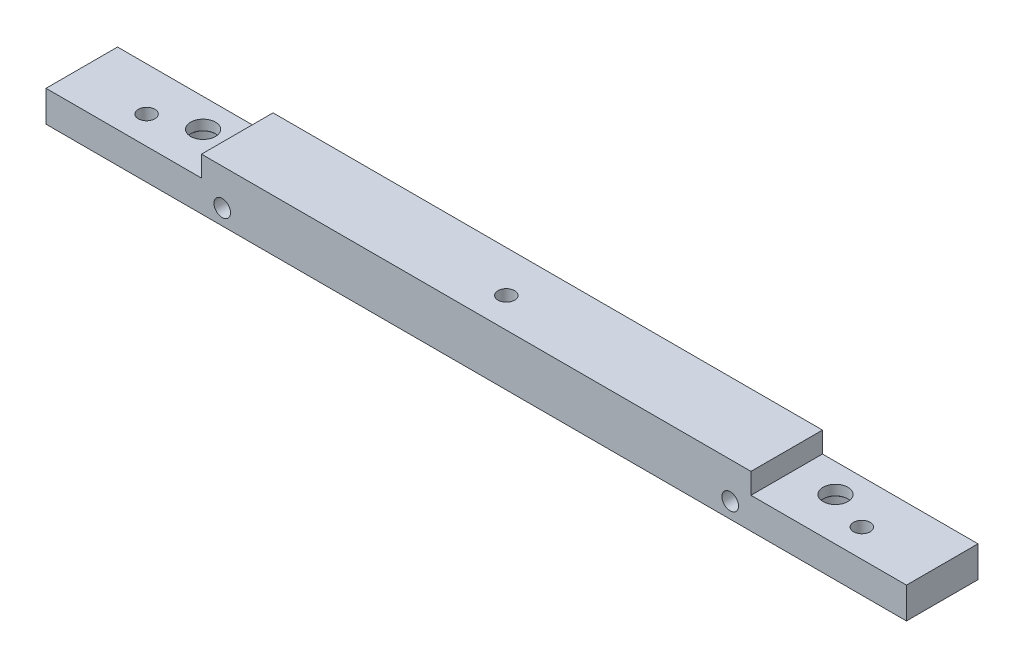
ISO-10303-21;
HEADER;
FILE_DESCRIPTION(('STEP AP214'),'2;1');
FILE_NAME('part.step','',(''),(''),'','','');
FILE_SCHEMA(('AUTOMOTIVE_DESIGN { 1 0 10303 214 1 1 1 1 }'));
ENDSEC;
DATA;
#1=APPLICATION_CONTEXT('core data for automotive mechanical design processes');
#2=APPLICATION_PROTOCOL_DEFINITION('international standard','automotive_design',2000,#1);
#3=PRODUCT_CONTEXT('',#1,'mechanical');
#4=PRODUCT('Part','Part','',(#3));
#5=PRODUCT_RELATED_PRODUCT_CATEGORY('part','',(#4));
#6=PRODUCT_DEFINITION_FORMATION('','',#4);
#7=PRODUCT_DEFINITION_CONTEXT('part definition',#1,'design');
#8=PRODUCT_DEFINITION('design','',#6,#7);
#9=PRODUCT_DEFINITION_SHAPE('','',#8);
#10=(LENGTH_UNIT() NAMED_UNIT(*) SI_UNIT(.MILLI.,.METRE.));
#11=(NAMED_UNIT(*) PLANE_ANGLE_UNIT() SI_UNIT($,.RADIAN.));
#12=(NAMED_UNIT(*) SI_UNIT($,.STERADIAN.) SOLID_ANGLE_UNIT());
#13=UNCERTAINTY_MEASURE_WITH_UNIT(LENGTH_MEASURE(1.E-05),#10,'distance_accuracy_value','');
#14=(GEOMETRIC_REPRESENTATION_CONTEXT(3) GLOBAL_UNCERTAINTY_ASSIGNED_CONTEXT((#13)) GLOBAL_UNIT_ASSIGNED_CONTEXT((#10,
#11,#12)) REPRESENTATION_CONTEXT('',''));
#15=CARTESIAN_POINT('',(0.,0.,0.));
#16=DIRECTION('',(0.,0.,1.));
#17=DIRECTION('',(1.,0.,0.));
#18=AXIS2_PLACEMENT_3D('',#15,#16,#17);
#19=CARTESIAN_POINT('',(0.,0.,8.5));
#20=DIRECTION('',(1.,0.,0.));
#21=DIRECTION('',(0.,1.,0.));
#22=AXIS2_PLACEMENT_3D('',#19,#20,#21);
#23=PLANE('',#22);
#24=DIRECTION('',(0.,0.,-1.));
#25=VECTOR('',#24,1.);
#26=CARTESIAN_POINT('',(0.,-3.,8.5));
#27=LINE('',#26,#25);
#28=CARTESIAN_POINT('',(0.,-3.,6.89999999999999));
#29=VERTEX_POINT('',#28);
#30=CARTESIAN_POINT('',(0.,-3.,0.));
#31=VERTEX_POINT('',#30);
#32=EDGE_CURVE('E11',#29,#31,#27,.T.);
#33=ORIENTED_EDGE('',*,*,#32,.F.);
#34=DIRECTION('',(0.,1.,0.));
#35=VECTOR('',#34,1.);
#36=CARTESIAN_POINT('',(0.,0.,6.89999999999999));
#37=LINE('',#36,#35);
#38=CARTESIAN_POINT('',(0.,-1.,6.89999999999999));
#39=VERTEX_POINT('',#38);
#40=EDGE_CURVE('E201',#29,#39,#37,.T.);
#41=ORIENTED_EDGE('',*,*,#40,.T.);
#42=DIRECTION('',(0.,0.,1.));
#43=VECTOR('',#42,1.);
#44=CARTESIAN_POINT('',(0.,-1.,0.));
#45=LINE('',#44,#43);
#46=CARTESIAN_POINT('',(0.,-1.,0.));
#47=VERTEX_POINT('',#46);
#48=EDGE_CURVE('E217',#47,#39,#45,.T.);
#49=ORIENTED_EDGE('',*,*,#48,.F.);
#50=DIRECTION('',(0.,-1.,0.));
#51=VECTOR('',#50,1.);
#52=CARTESIAN_POINT('',(0.,0.,0.));
#53=LINE('',#52,#51);
#54=EDGE_CURVE('E136',#47,#31,#53,.T.);
#55=ORIENTED_EDGE('',*,*,#54,.T.);
#56=EDGE_LOOP('',(#33,#41,#49,#55));
#57=FACE_BOUND('',#56,.T.);
#58=ADVANCED_FACE('F40',(#57),#23,.F.);
#59=CARTESIAN_POINT('',(-15.,-3.,8.5));
#60=DIRECTION('',(0.,-1.,0.));
#61=DIRECTION('',(1.,0.,0.));
#62=AXIS2_PLACEMENT_3D('',#59,#60,#61);
#63=PLANE('',#62);
#64=CARTESIAN_POINT('',(-8.,-3.,4.19999999999999));
#65=DIRECTION('',(0.,-1.,0.));
#66=DIRECTION('',(1.,0.,0.));
#67=AXIS2_PLACEMENT_3D('',#64,#65,#66);
#68=CIRCLE('',#67,0.799999999999993);
#69=CARTESIAN_POINT('',(-7.2,-3.,4.19999999999999));
#70=VERTEX_POINT('',#69);
#71=EDGE_CURVE('E440',#70,#70,#68,.T.);
#72=ORIENTED_EDGE('',*,*,#71,.T.);
#73=EDGE_LOOP('',(#72));
#74=FACE_BOUND('',#73,.T.);
#75=CARTESIAN_POINT('',(-4.,-3.,2.75));
#76=DIRECTION('',(0.,-1.,0.));
#77=DIRECTION('',(1.,0.,0.));
#78=AXIS2_PLACEMENT_3D('',#75,#76,#77);
#79=CIRCLE('',#78,1.2);
#80=CARTESIAN_POINT('',(-2.8,-3.,2.75));
#81=VERTEX_POINT('',#80);
#82=EDGE_CURVE('E138',#81,#81,#79,.T.);
#83=ORIENTED_EDGE('',*,*,#82,.T.);
#84=EDGE_LOOP('',(#83));
#85=FACE_BOUND('',#84,.T.);
#86=DIRECTION('',(0.,0.,-1.));
#87=VECTOR('',#86,1.);
#88=CARTESIAN_POINT('',(-15.,-3.,8.5));
#89=LINE('',#88,#87);
#90=CARTESIAN_POINT('',(-15.,-3.,6.89999999999999));
#91=VERTEX_POINT('',#90);
#92=CARTESIAN_POINT('',(-15.,-3.,0.));
#93=VERTEX_POINT('',#92);
#94=EDGE_CURVE('E48',#91,#93,#89,.T.);
#95=ORIENTED_EDGE('',*,*,#94,.F.);
#96=DIRECTION('',(1.,0.,0.));
#97=VECTOR('',#96,1.);
#98=CARTESIAN_POINT('',(-15.,-3.,6.89999999999999));
#99=LINE('',#98,#97);
#100=EDGE_CURVE('E109',#91,#29,#99,.T.);
#101=ORIENTED_EDGE('',*,*,#100,.T.);
#102=ORIENTED_EDGE('',*,*,#32,.T.);
#103=DIRECTION('',(-1.,0.,0.));
#104=VECTOR('',#103,1.);
#105=CARTESIAN_POINT('',(-15.,-3.,0.));
#106=LINE('',#105,#104);
#107=EDGE_CURVE('E166',#31,#93,#106,.T.);
#108=ORIENTED_EDGE('',*,*,#107,.T.);
#109=EDGE_LOOP('',(#95,#101,#102,#108));
#110=FACE_BOUND('',#109,.T.);
#111=ADVANCED_FACE('F258',(#74,#85,#110),#63,.F.);
#112=CARTESIAN_POINT('',(-15.,-3.,8.5));
#113=DIRECTION('',(1.,0.,0.));
#114=DIRECTION('',(0.,0.,-1.));
#115=AXIS2_PLACEMENT_3D('',#112,#113,#114);
#116=PLANE('',#115);
#117=DIRECTION('',(0.,0.,-1.));
#118=VECTOR('',#117,1.);
#119=CARTESIAN_POINT('',(-15.,-6.,8.5));
#120=LINE('',#119,#118);
#121=CARTESIAN_POINT('',(-15.,-6.,6.89999999999999));
#122=VERTEX_POINT('',#121);
#123=CARTESIAN_POINT('',(-15.,-6.,0.));
#124=VERTEX_POINT('',#123);
#125=EDGE_CURVE('E119',#122,#124,#120,.T.);
#126=ORIENTED_EDGE('',*,*,#125,.F.);
#127=DIRECTION('',(0.,-1.,0.));
#128=VECTOR('',#127,1.);
#129=CARTESIAN_POINT('',(-15.,4.,6.89999999999999));
#130=LINE('',#129,#128);
#131=EDGE_CURVE('E103',#91,#122,#130,.T.);
#132=ORIENTED_EDGE('',*,*,#131,.F.);
#133=ORIENTED_EDGE('',*,*,#94,.T.);
#134=DIRECTION('',(0.,-1.,0.));
#135=VECTOR('',#134,1.);
#136=CARTESIAN_POINT('',(-15.,-3.,0.));
#137=LINE('',#136,#135);
#138=EDGE_CURVE('E126',#93,#124,#137,.T.);
#139=ORIENTED_EDGE('',*,*,#138,.T.);
#140=EDGE_LOOP('',(#126,#132,#133,#139));
#141=FACE_BOUND('',#140,.T.);
#142=ADVANCED_FACE('F124',(#141),#116,.F.);
#143=CARTESIAN_POINT('',(-15.,-6.,8.5));
#144=DIRECTION('',(0.,1.,0.));
#145=DIRECTION('',(-1.,0.,0.));
#146=AXIS2_PLACEMENT_3D('',#143,#144,#145);
#147=PLANE('',#146);
#148=CARTESIAN_POINT('',(26.5,-6.,4.));
#149=DIRECTION('',(0.,-1.,0.));
#150=DIRECTION('',(0.,0.,-1.));
#151=AXIS2_PLACEMENT_3D('',#148,#149,#150);
#152=CIRCLE('',#151,0.799999999999999);
#153=CARTESIAN_POINT('',(26.5,-6.,3.2));
#154=VERTEX_POINT('',#153);
#155=EDGE_CURVE('E434',#154,#154,#152,.T.);
#156=ORIENTED_EDGE('',*,*,#155,.F.);
#157=EDGE_LOOP('',(#156));
#158=FACE_BOUND('',#157,.T.);
#159=CARTESIAN_POINT('',(-8.,-6.,4.19999999999999));
#160=DIRECTION('',(0.,-1.,0.));
#161=DIRECTION('',(0.,0.,-1.));
#162=AXIS2_PLACEMENT_3D('',#159,#160,#161);
#163=CIRCLE('',#162,0.799999999999988);
#164=CARTESIAN_POINT('',(-8.,-6.,3.4));
#165=VERTEX_POINT('',#164);
#166=EDGE_CURVE('E437',#165,#165,#163,.T.);
#167=ORIENTED_EDGE('',*,*,#166,.F.);
#168=EDGE_LOOP('',(#167));
#169=FACE_BOUND('',#168,.T.);
#170=CARTESIAN_POINT('',(61.,-6.,4.2));
#171=DIRECTION('',(0.,-1.,0.));
#172=DIRECTION('',(0.,0.,-1.));
#173=AXIS2_PLACEMENT_3D('',#170,#171,#172);
#174=CIRCLE('',#173,0.799999999999988);
#175=CARTESIAN_POINT('',(61.,-6.,3.40000000000001));
#176=VERTEX_POINT('',#175);
#177=EDGE_CURVE('E446',#176,#176,#174,.T.);
#178=ORIENTED_EDGE('',*,*,#177,.F.);
#179=EDGE_LOOP('',(#178));
#180=FACE_BOUND('',#179,.T.);
#181=CARTESIAN_POINT('',(-4.,-6.,2.75));
#182=DIRECTION('',(0.,-1.,0.));
#183=DIRECTION('',(0.,0.,-1.));
#184=AXIS2_PLACEMENT_3D('',#181,#182,#183);
#185=CIRCLE('',#184,2.2);
#186=CARTESIAN_POINT('',(-4.,-6.,0.550000000000001));
#187=VERTEX_POINT('',#186);
#188=EDGE_CURVE('E219',#187,#187,#185,.T.);
#189=ORIENTED_EDGE('',*,*,#188,.F.);
#190=EDGE_LOOP('',(#189));
#191=FACE_BOUND('',#190,.T.);
#192=CARTESIAN_POINT('',(57.,-6.,2.75));
#193=DIRECTION('',(0.,-1.,0.));
#194=DIRECTION('',(0.,0.,-1.));
#195=AXIS2_PLACEMENT_3D('',#192,#193,#194);
#196=CIRCLE('',#195,2.2);
#197=CARTESIAN_POINT('',(57.,-6.,0.55));
#198=VERTEX_POINT('',#197);
#199=EDGE_CURVE('E140',#198,#198,#196,.T.);
#200=ORIENTED_EDGE('',*,*,#199,.F.);
#201=EDGE_LOOP('',(#200));
#202=FACE_BOUND('',#201,.T.);
#203=DIRECTION('',(0.,0.,-1.));
#204=VECTOR('',#203,1.);
#205=CARTESIAN_POINT('',(68.,-6.,8.5));
#206=LINE('',#205,#204);
#207=CARTESIAN_POINT('',(68.,-6.,6.9));
#208=VERTEX_POINT('',#207);
#209=CARTESIAN_POINT('',(68.,-6.,0.));
#210=VERTEX_POINT('',#209);
#211=EDGE_CURVE('E121',#208,#210,#206,.T.);
#212=ORIENTED_EDGE('',*,*,#211,.F.);
#213=DIRECTION('',(1.,0.,0.));
#214=VECTOR('',#213,1.);
#215=CARTESIAN_POINT('',(68.,-6.,6.9));
#216=LINE('',#215,#214);
#217=EDGE_CURVE('E106',#122,#208,#216,.T.);
#218=ORIENTED_EDGE('',*,*,#217,.F.);
#219=ORIENTED_EDGE('',*,*,#125,.T.);
#220=DIRECTION('',(1.,0.,0.));
#221=VECTOR('',#220,1.);
#222=CARTESIAN_POINT('',(-15.,-6.,0.));
#223=LINE('',#222,#221);
#224=EDGE_CURVE('E170',#124,#210,#223,.T.);
#225=ORIENTED_EDGE('',*,*,#224,.T.);
#226=EDGE_LOOP('',(#212,#218,#219,#225));
#227=FACE_BOUND('',#226,.T.);
#228=ADVANCED_FACE('F117',(#158,#169,#180,#191,#202,#227),#147,.F.);
#229=CARTESIAN_POINT('',(68.,-2.99999999999999,8.5));
#230=DIRECTION('',(-1.,0.,0.));
#231=DIRECTION('',(0.,0.,1.));
#232=AXIS2_PLACEMENT_3D('',#229,#230,#231);
#233=PLANE('',#232);
#234=DIRECTION('',(0.,0.,-1.));
#235=VECTOR('',#234,1.);
#236=CARTESIAN_POINT('',(68.,-2.99999999999999,8.5));
#237=LINE('',#236,#235);
#238=CARTESIAN_POINT('',(68.,-2.99999999999999,6.9));
#239=VERTEX_POINT('',#238);
#240=CARTESIAN_POINT('',(68.,-2.99999999999999,0.));
#241=VERTEX_POINT('',#240);
#242=EDGE_CURVE('E130',#239,#241,#237,.T.);
#243=ORIENTED_EDGE('',*,*,#242,.F.);
#244=DIRECTION('',(0.,-1.,0.));
#245=VECTOR('',#244,1.);
#246=CARTESIAN_POINT('',(68.,4.,6.9));
#247=LINE('',#246,#245);
#248=EDGE_CURVE('E113',#239,#208,#247,.T.);
#249=ORIENTED_EDGE('',*,*,#248,.T.);
#250=ORIENTED_EDGE('',*,*,#211,.T.);
#251=DIRECTION('',(0.,1.,0.));
#252=VECTOR('',#251,1.);
#253=CARTESIAN_POINT('',(68.,-2.99999999999999,0.));
#254=LINE('',#253,#252);
#255=EDGE_CURVE('E172',#210,#241,#254,.T.);
#256=ORIENTED_EDGE('',*,*,#255,.T.);
#257=EDGE_LOOP('',(#243,#249,#250,#256));
#258=FACE_BOUND('',#257,.T.);
#259=ADVANCED_FACE('F192',(#258),#233,.F.);
#260=CARTESIAN_POINT('',(53.,-2.99999999999999,8.5));
#261=DIRECTION('',(0.,-1.,0.));
#262=DIRECTION('',(1.,0.,0.));
#263=AXIS2_PLACEMENT_3D('',#260,#261,#262);
#264=PLANE('',#263);
#265=CARTESIAN_POINT('',(61.,-2.99999999999999,4.2));
#266=DIRECTION('',(0.,-1.,0.));
#267=DIRECTION('',(1.,0.,0.));
#268=AXIS2_PLACEMENT_3D('',#265,#266,#267);
#269=CIRCLE('',#268,0.799999999999995);
#270=CARTESIAN_POINT('',(61.8,-2.99999999999999,4.2));
#271=VERTEX_POINT('',#270);
#272=EDGE_CURVE('E122',#271,#271,#269,.T.);
#273=ORIENTED_EDGE('',*,*,#272,.T.);
#274=EDGE_LOOP('',(#273));
#275=FACE_BOUND('',#274,.T.);
#276=CARTESIAN_POINT('',(57.,-2.99999999999999,2.75));
#277=DIRECTION('',(0.,-1.,0.));
#278=DIRECTION('',(1.,0.,0.));
#279=AXIS2_PLACEMENT_3D('',#276,#277,#278);
#280=CIRCLE('',#279,1.2);
#281=CARTESIAN_POINT('',(58.2,-2.99999999999999,2.75));
#282=VERTEX_POINT('',#281);
#283=EDGE_CURVE('E134',#282,#282,#280,.T.);
#284=ORIENTED_EDGE('',*,*,#283,.T.);
#285=EDGE_LOOP('',(#284));
#286=FACE_BOUND('',#285,.T.);
#287=DIRECTION('',(0.,0.,-1.));
#288=VECTOR('',#287,1.);
#289=CARTESIAN_POINT('',(53.,-2.99999999999999,8.5));
#290=LINE('',#289,#288);
#291=CARTESIAN_POINT('',(53.,-2.99999999999999,6.9));
#292=VERTEX_POINT('',#291);
#293=CARTESIAN_POINT('',(53.,-2.99999999999999,0.));
#294=VERTEX_POINT('',#293);
#295=EDGE_CURVE('E181',#292,#294,#290,.T.);
#296=ORIENTED_EDGE('',*,*,#295,.F.);
#297=DIRECTION('',(1.,0.,0.));
#298=VECTOR('',#297,1.);
#299=CARTESIAN_POINT('',(53.,-2.99999999999999,6.9));
#300=LINE('',#299,#298);
#301=EDGE_CURVE('E189',#292,#239,#300,.T.);
#302=ORIENTED_EDGE('',*,*,#301,.T.);
#303=ORIENTED_EDGE('',*,*,#242,.T.);
#304=DIRECTION('',(-1.,0.,0.));
#305=VECTOR('',#304,1.);
#306=CARTESIAN_POINT('',(53.,-2.99999999999999,0.));
#307=LINE('',#306,#305);
#308=EDGE_CURVE('E175',#241,#294,#307,.T.);
#309=ORIENTED_EDGE('',*,*,#308,.T.);
#310=EDGE_LOOP('',(#296,#302,#303,#309));
#311=FACE_BOUND('',#310,.T.);
#312=ADVANCED_FACE('F186',(#275,#286,#311),#264,.F.);
#313=CARTESIAN_POINT('',(53.,0.,8.5));
#314=DIRECTION('',(-1.,0.,0.));
#315=DIRECTION('',(0.,0.,1.));
#316=AXIS2_PLACEMENT_3D('',#313,#314,#315);
#317=PLANE('',#316);
#318=DIRECTION('',(0.,0.,1.));
#319=VECTOR('',#318,1.);
#320=CARTESIAN_POINT('',(53.,-1.,0.));
#321=LINE('',#320,#319);
#322=CARTESIAN_POINT('',(53.,-1.,0.));
#323=VERTEX_POINT('',#322);
#324=CARTESIAN_POINT('',(53.,-1.,6.9));
#325=VERTEX_POINT('',#324);
#326=EDGE_CURVE('E63',#323,#325,#321,.T.);
#327=ORIENTED_EDGE('',*,*,#326,.T.);
#328=DIRECTION('',(0.,-1.,0.));
#329=VECTOR('',#328,1.);
#330=CARTESIAN_POINT('',(53.,0.,6.9));
#331=LINE('',#330,#329);
#332=EDGE_CURVE('E56',#325,#292,#331,.T.);
#333=ORIENTED_EDGE('',*,*,#332,.T.);
#334=ORIENTED_EDGE('',*,*,#295,.T.);
#335=DIRECTION('',(0.,1.,0.));
#336=VECTOR('',#335,1.);
#337=CARTESIAN_POINT('',(53.,0.,0.));
#338=LINE('',#337,#336);
#339=EDGE_CURVE('E178',#294,#323,#338,.T.);
#340=ORIENTED_EDGE('',*,*,#339,.T.);
#341=EDGE_LOOP('',(#327,#333,#334,#340));
#342=FACE_BOUND('',#341,.T.);
#343=ADVANCED_FACE('F198',(#342),#317,.F.);
#344=CARTESIAN_POINT('',(0.,0.,0.));
#345=DIRECTION('',(0.,0.,1.));
#346=DIRECTION('',(1.,0.,0.));
#347=AXIS2_PLACEMENT_3D('',#344,#345,#346);
#348=PLANE('',#347);
#349=CARTESIAN_POINT('',(2.,-4.5,0.));
#350=DIRECTION('',(0.,0.,1.));
#351=DIRECTION('',(1.,0.,0.));
#352=AXIS2_PLACEMENT_3D('',#349,#350,#351);
#353=CIRCLE('',#352,0.799999999999998);
#354=CARTESIAN_POINT('',(2.8,-4.5,0.));
#355=VERTEX_POINT('',#354);
#356=EDGE_CURVE('E210',#355,#355,#353,.T.);
#357=ORIENTED_EDGE('',*,*,#356,.T.);
#358=EDGE_LOOP('',(#357));
#359=FACE_BOUND('',#358,.T.);
#360=CARTESIAN_POINT('',(51.,-4.5,0.));
#361=DIRECTION('',(0.,0.,1.));
#362=DIRECTION('',(1.,0.,0.));
#363=AXIS2_PLACEMENT_3D('',#360,#361,#362);
#364=CIRCLE('',#363,0.799999999999995);
#365=CARTESIAN_POINT('',(51.8,-4.5,0.));
#366=VERTEX_POINT('',#365);
#367=EDGE_CURVE('E213',#366,#366,#364,.T.);
#368=ORIENTED_EDGE('',*,*,#367,.T.);
#369=EDGE_LOOP('',(#368));
#370=FACE_BOUND('',#369,.T.);
#371=ORIENTED_EDGE('',*,*,#54,.F.);
#372=DIRECTION('',(1.,0.,0.));
#373=VECTOR('',#372,1.);
#374=CARTESIAN_POINT('',(0.,-1.,0.));
#375=LINE('',#374,#373);
#376=EDGE_CURVE('E196',#47,#323,#375,.T.);
#377=ORIENTED_EDGE('',*,*,#376,.T.);
#378=ORIENTED_EDGE('',*,*,#339,.F.);
#379=ORIENTED_EDGE('',*,*,#308,.F.);
#380=ORIENTED_EDGE('',*,*,#255,.F.);
#381=ORIENTED_EDGE('',*,*,#224,.F.);
#382=ORIENTED_EDGE('',*,*,#138,.F.);
#383=ORIENTED_EDGE('',*,*,#107,.F.);
#384=EDGE_LOOP('',(#371,#377,#378,#379,#380,#381,#382,#383));
#385=FACE_BOUND('',#384,.T.);
#386=ADVANCED_FACE('F195',(#359,#370,#385),#348,.F.);
#387=CARTESIAN_POINT('',(57.,-6.,2.75));
#388=DIRECTION('',(0.,-1.,0.));
#389=DIRECTION('',(0.,0.,-1.));
#390=AXIS2_PLACEMENT_3D('',#387,#388,#389);
#391=CYLINDRICAL_SURFACE('',#390,1.2);
#392=CARTESIAN_POINT('',(57.,-3.975,2.75));
#393=DIRECTION('',(0.,-1.,0.));
#394=DIRECTION('',(0.,0.,-1.));
#395=AXIS2_PLACEMENT_3D('',#392,#393,#394);
#396=CIRCLE('',#395,1.2);
#397=CARTESIAN_POINT('',(57.,-3.975,1.55));
#398=VERTEX_POINT('',#397);
#399=EDGE_CURVE('E137',#398,#398,#396,.T.);
#400=ORIENTED_EDGE('',*,*,#399,.T.);
#401=EDGE_LOOP('',(#400));
#402=FACE_BOUND('',#401,.T.);
#403=ORIENTED_EDGE('',*,*,#283,.F.);
#404=EDGE_LOOP('',(#403));
#405=FACE_BOUND('',#404,.T.);
#406=ADVANCED_FACE('F309',(#402,#405),#391,.F.);
#407=CARTESIAN_POINT('',(57.,-4.,2.75));
#408=DIRECTION('',(0.,-1.,0.));
#409=DIRECTION('',(0.,0.,-1.));
#410=AXIS2_PLACEMENT_3D('',#407,#408,#409);
#411=CONICAL_SURFACE('',#410,1.225,0.785398163397396);
#412=ORIENTED_EDGE('',*,*,#399,.F.);
#413=EDGE_LOOP('',(#412));
#414=FACE_BOUND('',#413,.T.);
#415=CARTESIAN_POINT('',(57.,-4.,2.75));
#416=DIRECTION('',(0.,-1.,0.));
#417=DIRECTION('',(0.,0.,-1.));
#418=AXIS2_PLACEMENT_3D('',#415,#416,#417);
#419=CIRCLE('',#418,1.225);
#420=CARTESIAN_POINT('',(57.,-4.,1.525));
#421=VERTEX_POINT('',#420);
#422=EDGE_CURVE('E159',#421,#421,#419,.T.);
#423=ORIENTED_EDGE('',*,*,#422,.T.);
#424=EDGE_LOOP('',(#423));
#425=FACE_BOUND('',#424,.T.);
#426=ADVANCED_FACE('F253',(#414,#425),#411,.F.);
#427=CARTESIAN_POINT('',(58.225,-4.,2.75));
#428=DIRECTION('',(0.,1.,0.));
#429=DIRECTION('',(0.,0.,1.));
#430=AXIS2_PLACEMENT_3D('',#427,#428,#429);
#431=PLANE('',#430);
#432=ORIENTED_EDGE('',*,*,#422,.F.);
#433=EDGE_LOOP('',(#432));
#434=FACE_BOUND('',#433,.T.);
#435=CARTESIAN_POINT('',(57.,-4.,2.75));
#436=DIRECTION('',(0.,-1.,0.));
#437=DIRECTION('',(0.,0.,-1.));
#438=AXIS2_PLACEMENT_3D('',#435,#436,#437);
#439=CIRCLE('',#438,2.2);
#440=CARTESIAN_POINT('',(57.,-4.,0.55));
#441=VERTEX_POINT('',#440);
#442=EDGE_CURVE('E145',#441,#441,#439,.T.);
#443=ORIENTED_EDGE('',*,*,#442,.T.);
#444=EDGE_LOOP('',(#443));
#445=FACE_BOUND('',#444,.T.);
#446=ADVANCED_FACE('F244',(#434,#445),#431,.F.);
#447=CARTESIAN_POINT('',(57.,-6.,2.75));
#448=DIRECTION('',(0.,-1.,0.));
#449=DIRECTION('',(0.,0.,-1.));
#450=AXIS2_PLACEMENT_3D('',#447,#448,#449);
#451=CYLINDRICAL_SURFACE('',#450,2.2);
#452=ORIENTED_EDGE('',*,*,#442,.F.);
#453=EDGE_LOOP('',(#452));
#454=FACE_BOUND('',#453,.T.);
#455=ORIENTED_EDGE('',*,*,#199,.T.);
#456=EDGE_LOOP('',(#455));
#457=FACE_BOUND('',#456,.T.);
#458=ADVANCED_FACE('F241',(#454,#457),#451,.F.);
#459=CARTESIAN_POINT('',(-4.,-6.,2.75));
#460=DIRECTION('',(0.,-1.,0.));
#461=DIRECTION('',(0.,0.,-1.));
#462=AXIS2_PLACEMENT_3D('',#459,#460,#461);
#463=CYLINDRICAL_SURFACE('',#462,1.2);
#464=CARTESIAN_POINT('',(-4.,-3.975,2.75));
#465=DIRECTION('',(0.,-1.,0.));
#466=DIRECTION('',(0.,0.,-1.));
#467=AXIS2_PLACEMENT_3D('',#464,#465,#466);
#468=CIRCLE('',#467,1.2);
#469=CARTESIAN_POINT('',(-4.,-3.975,1.55));
#470=VERTEX_POINT('',#469);
#471=EDGE_CURVE('E141',#470,#470,#468,.T.);
#472=ORIENTED_EDGE('',*,*,#471,.T.);
#473=EDGE_LOOP('',(#472));
#474=FACE_BOUND('',#473,.T.);
#475=ORIENTED_EDGE('',*,*,#82,.F.);
#476=EDGE_LOOP('',(#475));
#477=FACE_BOUND('',#476,.T.);
#478=ADVANCED_FACE('F243',(#474,#477),#463,.F.);
#479=CARTESIAN_POINT('',(-4.,-4.,2.75));
#480=DIRECTION('',(0.,-1.,0.));
#481=DIRECTION('',(0.,0.,-1.));
#482=AXIS2_PLACEMENT_3D('',#479,#480,#481);
#483=CONICAL_SURFACE('',#482,1.225,0.785398163397448);
#484=ORIENTED_EDGE('',*,*,#471,.F.);
#485=EDGE_LOOP('',(#484));
#486=FACE_BOUND('',#485,.T.);
#487=CARTESIAN_POINT('',(-4.,-4.,2.75));
#488=DIRECTION('',(0.,-1.,0.));
#489=DIRECTION('',(0.,0.,-1.));
#490=AXIS2_PLACEMENT_3D('',#487,#488,#489);
#491=CIRCLE('',#490,1.225);
#492=CARTESIAN_POINT('',(-4.,-4.,1.525));
#493=VERTEX_POINT('',#492);
#494=EDGE_CURVE('E148',#493,#493,#491,.T.);
#495=ORIENTED_EDGE('',*,*,#494,.T.);
#496=EDGE_LOOP('',(#495));
#497=FACE_BOUND('',#496,.T.);
#498=ADVANCED_FACE('F251',(#486,#497),#483,.F.);
#499=CARTESIAN_POINT('',(-2.775,-4.,2.75));
#500=DIRECTION('',(0.,1.,0.));
#501=DIRECTION('',(0.,0.,1.));
#502=AXIS2_PLACEMENT_3D('',#499,#500,#501);
#503=PLANE('',#502);
#504=ORIENTED_EDGE('',*,*,#494,.F.);
#505=EDGE_LOOP('',(#504));
#506=FACE_BOUND('',#505,.T.);
#507=CARTESIAN_POINT('',(-4.,-4.,2.75));
#508=DIRECTION('',(0.,-1.,0.));
#509=DIRECTION('',(0.,0.,-1.));
#510=AXIS2_PLACEMENT_3D('',#507,#508,#509);
#511=CIRCLE('',#510,2.2);
#512=CARTESIAN_POINT('',(-4.,-4.,0.550000000000001));
#513=VERTEX_POINT('',#512);
#514=EDGE_CURVE('E153',#513,#513,#511,.T.);
#515=ORIENTED_EDGE('',*,*,#514,.T.);
#516=EDGE_LOOP('',(#515));
#517=FACE_BOUND('',#516,.T.);
#518=ADVANCED_FACE('F226',(#506,#517),#503,.F.);
#519=CARTESIAN_POINT('',(-4.,-6.,2.75));
#520=DIRECTION('',(0.,-1.,0.));
#521=DIRECTION('',(0.,0.,-1.));
#522=AXIS2_PLACEMENT_3D('',#519,#520,#521);
#523=CYLINDRICAL_SURFACE('',#522,2.2);
#524=ORIENTED_EDGE('',*,*,#514,.F.);
#525=EDGE_LOOP('',(#524));
#526=FACE_BOUND('',#525,.T.);
#527=ORIENTED_EDGE('',*,*,#188,.T.);
#528=EDGE_LOOP('',(#527));
#529=FACE_BOUND('',#528,.T.);
#530=ADVANCED_FACE('F228',(#526,#529),#523,.F.);
#531=CARTESIAN_POINT('',(0.,-1.,0.));
#532=DIRECTION('',(0.,-1.,0.));
#533=DIRECTION('',(0.,0.,-1.));
#534=AXIS2_PLACEMENT_3D('',#531,#532,#533);
#535=PLANE('',#534);
#536=CARTESIAN_POINT('',(26.5,-1.,4.));
#537=DIRECTION('',(0.,-1.,0.));
#538=DIRECTION('',(0.,0.,-1.));
#539=AXIS2_PLACEMENT_3D('',#536,#537,#538);
#540=CIRCLE('',#539,0.799999999999999);
#541=CARTESIAN_POINT('',(26.5,-1.,3.2));
#542=VERTEX_POINT('',#541);
#543=EDGE_CURVE('E436',#542,#542,#540,.T.);
#544=ORIENTED_EDGE('',*,*,#543,.T.);
#545=EDGE_LOOP('',(#544));
#546=FACE_BOUND('',#545,.T.);
#547=ORIENTED_EDGE('',*,*,#48,.T.);
#548=DIRECTION('',(1.,0.,0.));
#549=VECTOR('',#548,1.);
#550=CARTESIAN_POINT('',(0.,-1.,6.89999999999999));
#551=LINE('',#550,#549);
#552=EDGE_CURVE('E199',#39,#325,#551,.T.);
#553=ORIENTED_EDGE('',*,*,#552,.T.);
#554=ORIENTED_EDGE('',*,*,#326,.F.);
#555=ORIENTED_EDGE('',*,*,#376,.F.);
#556=EDGE_LOOP('',(#547,#553,#554,#555));
#557=FACE_BOUND('',#556,.T.);
#558=ADVANCED_FACE('F231',(#546,#557),#535,.F.);
#559=CARTESIAN_POINT('',(51.,-4.5,8.5));
#560=DIRECTION('',(0.,0.,1.));
#561=DIRECTION('',(1.,0.,0.));
#562=AXIS2_PLACEMENT_3D('',#559,#560,#561);
#563=CYLINDRICAL_SURFACE('',#562,0.799999999999999);
#564=CARTESIAN_POINT('',(51.,-4.5,6.9));
#565=DIRECTION('',(0.,0.,-1.));
#566=DIRECTION('',(-1.,0.,0.));
#567=AXIS2_PLACEMENT_3D('',#564,#565,#566);
#568=CIRCLE('',#567,0.799999999999999);
#569=CARTESIAN_POINT('',(50.2,-4.5,6.9));
#570=VERTEX_POINT('',#569);
#571=EDGE_CURVE('E203',#570,#570,#568,.F.);
#572=ORIENTED_EDGE('',*,*,#571,.T.);
#573=EDGE_LOOP('',(#572));
#574=FACE_BOUND('',#573,.T.);
#575=ORIENTED_EDGE('',*,*,#367,.F.);
#576=EDGE_LOOP('',(#575));
#577=FACE_BOUND('',#576,.T.);
#578=ADVANCED_FACE('F269',(#574,#577),#563,.F.);
#579=CARTESIAN_POINT('',(2.,-4.5,8.5));
#580=DIRECTION('',(0.,0.,1.));
#581=DIRECTION('',(1.,0.,0.));
#582=AXIS2_PLACEMENT_3D('',#579,#580,#581);
#583=CYLINDRICAL_SURFACE('',#582,0.799999999999998);
#584=CARTESIAN_POINT('',(2.,-4.5,6.89999999999999));
#585=DIRECTION('',(0.,0.,-1.));
#586=DIRECTION('',(-1.,0.,0.));
#587=AXIS2_PLACEMENT_3D('',#584,#585,#586);
#588=CIRCLE('',#587,0.799999999999998);
#589=CARTESIAN_POINT('',(1.20000000000001,-4.5,6.89999999999999));
#590=VERTEX_POINT('',#589);
#591=EDGE_CURVE('E43',#590,#590,#588,.F.);
#592=ORIENTED_EDGE('',*,*,#591,.T.);
#593=EDGE_LOOP('',(#592));
#594=FACE_BOUND('',#593,.T.);
#595=ORIENTED_EDGE('',*,*,#356,.F.);
#596=EDGE_LOOP('',(#595));
#597=FACE_BOUND('',#596,.T.);
#598=ADVANCED_FACE('F275',(#594,#597),#583,.F.);
#599=CARTESIAN_POINT('',(68.,4.,6.9));
#600=DIRECTION('',(0.,0.,-1.));
#601=DIRECTION('',(-1.,0.,0.));
#602=AXIS2_PLACEMENT_3D('',#599,#600,#601);
#603=PLANE('',#602);
#604=ORIENTED_EDGE('',*,*,#571,.F.);
#605=EDGE_LOOP('',(#604));
#606=FACE_BOUND('',#605,.T.);
#607=ORIENTED_EDGE('',*,*,#591,.F.);
#608=EDGE_LOOP('',(#607));
#609=FACE_BOUND('',#608,.T.);
#610=ORIENTED_EDGE('',*,*,#131,.T.);
#611=ORIENTED_EDGE('',*,*,#217,.T.);
#612=ORIENTED_EDGE('',*,*,#248,.F.);
#613=ORIENTED_EDGE('',*,*,#301,.F.);
#614=ORIENTED_EDGE('',*,*,#332,.F.);
#615=ORIENTED_EDGE('',*,*,#552,.F.);
#616=ORIENTED_EDGE('',*,*,#40,.F.);
#617=ORIENTED_EDGE('',*,*,#100,.F.);
#618=EDGE_LOOP('',(#610,#611,#612,#613,#614,#615,#616,#617));
#619=FACE_BOUND('',#618,.T.);
#620=ADVANCED_FACE('F105',(#606,#609,#619),#603,.F.);
#621=CARTESIAN_POINT('',(61.,-6.,4.2));
#622=DIRECTION('',(0.,-1.,0.));
#623=DIRECTION('',(0.,0.,-1.));
#624=AXIS2_PLACEMENT_3D('',#621,#622,#623);
#625=CYLINDRICAL_SURFACE('',#624,0.799999999999995);
#626=ORIENTED_EDGE('',*,*,#177,.T.);
#627=EDGE_LOOP('',(#626));
#628=FACE_BOUND('',#627,.T.);
#629=ORIENTED_EDGE('',*,*,#272,.F.);
#630=EDGE_LOOP('',(#629));
#631=FACE_BOUND('',#630,.T.);
#632=ADVANCED_FACE('F370',(#628,#631),#625,.F.);
#633=CARTESIAN_POINT('',(-8.,-6.,4.19999999999999));
#634=DIRECTION('',(0.,-1.,0.));
#635=DIRECTION('',(0.,0.,-1.));
#636=AXIS2_PLACEMENT_3D('',#633,#634,#635);
#637=CYLINDRICAL_SURFACE('',#636,0.799999999999993);
#638=ORIENTED_EDGE('',*,*,#166,.T.);
#639=EDGE_LOOP('',(#638));
#640=FACE_BOUND('',#639,.T.);
#641=ORIENTED_EDGE('',*,*,#71,.F.);
#642=EDGE_LOOP('',(#641));
#643=FACE_BOUND('',#642,.T.);
#644=ADVANCED_FACE('F393',(#640,#643),#637,.F.);
#645=CARTESIAN_POINT('',(26.5,-6.,4.));
#646=DIRECTION('',(0.,-1.,0.));
#647=DIRECTION('',(0.,0.,-1.));
#648=AXIS2_PLACEMENT_3D('',#645,#646,#647);
#649=CYLINDRICAL_SURFACE('',#648,0.799999999999999);
#650=ORIENTED_EDGE('',*,*,#155,.T.);
#651=EDGE_LOOP('',(#650));
#652=FACE_BOUND('',#651,.T.);
#653=ORIENTED_EDGE('',*,*,#543,.F.);
#654=EDGE_LOOP('',(#653));
#655=FACE_BOUND('',#654,.T.);
#656=ADVANCED_FACE('F404',(#652,#655),#649,.F.);
#657=CLOSED_SHELL('',(#58,#111,#142,#228,#259,#312,#343,#386,#406,#426,#446,#458,#478,#498,#518,
#530,#558,#578,#598,#620,#632,#644,#656));
#658=MANIFOLD_SOLID_BREP('B2',#657);
#659=ADVANCED_BREP_SHAPE_REPRESENTATION('',(#18,#658),#14);
#660=SHAPE_DEFINITION_REPRESENTATION(#9,#659);
ENDSEC;
END-ISO-10303-21;
